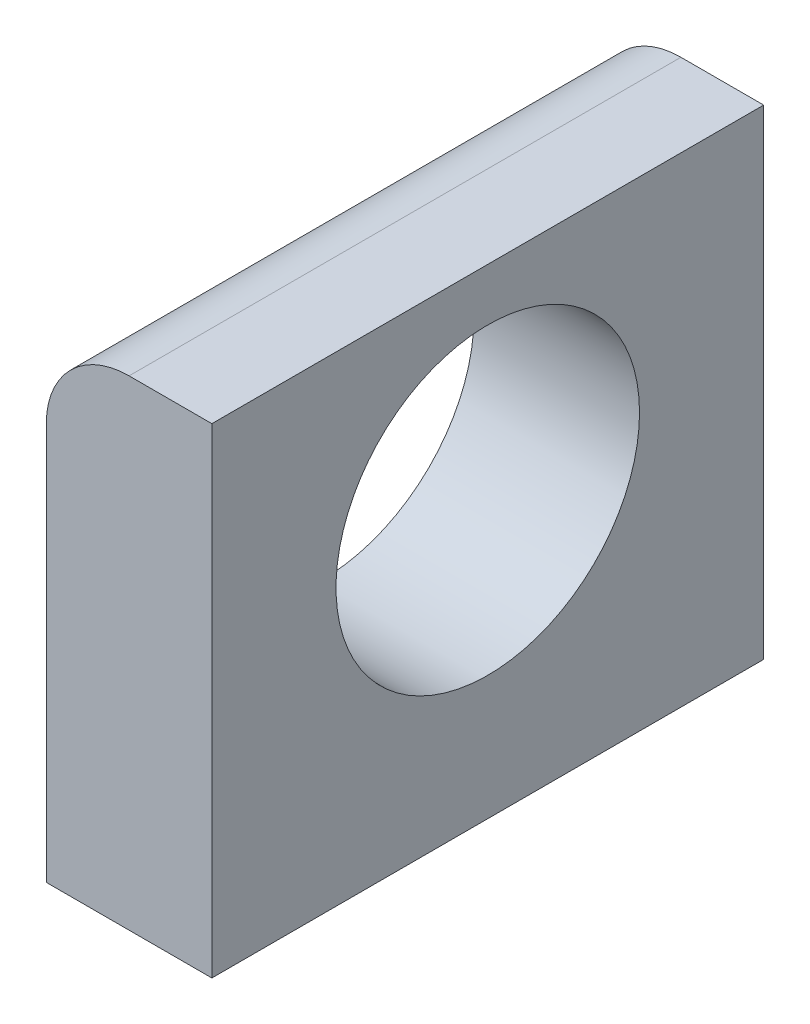
ISO-10303-21;
HEADER;
FILE_DESCRIPTION(('STEP AP214'),'2;1');
FILE_NAME('part.step','',(''),(''),'','','');
FILE_SCHEMA(('AUTOMOTIVE_DESIGN { 1 0 10303 214 1 1 1 1 }'));
ENDSEC;
DATA;
#1=APPLICATION_CONTEXT('core data for automotive mechanical design processes');
#2=APPLICATION_PROTOCOL_DEFINITION('international standard','automotive_design',2000,#1);
#3=PRODUCT_CONTEXT('',#1,'mechanical');
#4=PRODUCT('Part','Part','',(#3));
#5=PRODUCT_RELATED_PRODUCT_CATEGORY('part','',(#4));
#6=PRODUCT_DEFINITION_FORMATION('','',#4);
#7=PRODUCT_DEFINITION_CONTEXT('part definition',#1,'design');
#8=PRODUCT_DEFINITION('design','',#6,#7);
#9=PRODUCT_DEFINITION_SHAPE('','',#8);
#10=(LENGTH_UNIT() NAMED_UNIT(*) SI_UNIT(.MILLI.,.METRE.));
#11=(NAMED_UNIT(*) PLANE_ANGLE_UNIT() SI_UNIT($,.RADIAN.));
#12=(NAMED_UNIT(*) SI_UNIT($,.STERADIAN.) SOLID_ANGLE_UNIT());
#13=UNCERTAINTY_MEASURE_WITH_UNIT(LENGTH_MEASURE(1.E-05),#10,'distance_accuracy_value','');
#14=(GEOMETRIC_REPRESENTATION_CONTEXT(3) GLOBAL_UNCERTAINTY_ASSIGNED_CONTEXT((#13)) GLOBAL_UNIT_ASSIGNED_CONTEXT((#10,
#11,#12)) REPRESENTATION_CONTEXT('',''));
#15=CARTESIAN_POINT('',(0.,0.,0.));
#16=DIRECTION('',(0.,0.,1.));
#17=DIRECTION('',(1.,0.,0.));
#18=AXIS2_PLACEMENT_3D('',#15,#16,#17);
#19=CARTESIAN_POINT('',(1.5,-4.35,10.));
#20=DIRECTION('',(-1.,0.,0.));
#21=DIRECTION('',(0.,0.,1.));
#22=AXIS2_PLACEMENT_3D('',#19,#20,#21);
#23=PLANE('',#22);
#24=CARTESIAN_POINT('',(1.5,0.65,5.));
#25=DIRECTION('',(1.,0.,0.));
#26=DIRECTION('',(0.,0.,-1.));
#27=AXIS2_PLACEMENT_3D('',#24,#25,#26);
#28=CIRCLE('',#27,2.75);
#29=CARTESIAN_POINT('',(1.5,0.65,2.25));
#30=VERTEX_POINT('',#29);
#31=EDGE_CURVE('E131',#30,#30,#28,.T.);
#32=ORIENTED_EDGE('',*,*,#31,.F.);
#33=EDGE_LOOP('',(#32));
#34=FACE_BOUND('',#33,.T.);
#35=DIRECTION('',(0.,1.,0.));
#36=VECTOR('',#35,1.);
#37=CARTESIAN_POINT('',(1.5,-4.35,0.));
#38=LINE('',#37,#36);
#39=CARTESIAN_POINT('',(1.5,-4.35,0.));
#40=VERTEX_POINT('',#39);
#41=CARTESIAN_POINT('',(1.5,4.35,0.));
#42=VERTEX_POINT('',#41);
#43=EDGE_CURVE('E114',#40,#42,#38,.T.);
#44=ORIENTED_EDGE('',*,*,#43,.T.);
#45=DIRECTION('',(0.,0.,-1.));
#46=VECTOR('',#45,1.);
#47=CARTESIAN_POINT('',(1.5,4.35,10.));
#48=LINE('',#47,#46);
#49=CARTESIAN_POINT('',(1.5,4.35,10.));
#50=VERTEX_POINT('',#49);
#51=EDGE_CURVE('E95',#50,#42,#48,.T.);
#52=ORIENTED_EDGE('',*,*,#51,.F.);
#53=DIRECTION('',(0.,1.,0.));
#54=VECTOR('',#53,1.);
#55=CARTESIAN_POINT('',(1.5,-4.35,10.));
#56=LINE('',#55,#54);
#57=CARTESIAN_POINT('',(1.5,-4.35,10.));
#58=VERTEX_POINT('',#57);
#59=EDGE_CURVE('E101',#58,#50,#56,.T.);
#60=ORIENTED_EDGE('',*,*,#59,.F.);
#61=DIRECTION('',(0.,0.,-1.));
#62=VECTOR('',#61,1.);
#63=CARTESIAN_POINT('',(1.5,-4.35,10.));
#64=LINE('',#63,#62);
#65=EDGE_CURVE('E124',#58,#40,#64,.T.);
#66=ORIENTED_EDGE('',*,*,#65,.T.);
#67=EDGE_LOOP('',(#44,#52,#60,#66));
#68=FACE_BOUND('',#67,.T.);
#69=ADVANCED_FACE('F39',(#34,#68),#23,.F.);
#70=CARTESIAN_POINT('',(-1.5,4.35,10.));
#71=DIRECTION('',(0.,-1.,0.));
#72=DIRECTION('',(0.,0.,-1.));
#73=AXIS2_PLACEMENT_3D('',#70,#71,#72);
#74=PLANE('',#73);
#75=DIRECTION('',(-1.,0.,0.));
#76=VECTOR('',#75,1.);
#77=CARTESIAN_POINT('',(-1.5,4.35,0.));
#78=LINE('',#77,#76);
#79=CARTESIAN_POINT('',(0.,4.35,0.));
#80=VERTEX_POINT('',#79);
#81=EDGE_CURVE('E178',#42,#80,#78,.T.);
#82=ORIENTED_EDGE('',*,*,#81,.T.);
#83=DIRECTION('',(0.,0.,-1.));
#84=VECTOR('',#83,1.);
#85=CARTESIAN_POINT('',(0.,4.35,10.));
#86=LINE('',#85,#84);
#87=CARTESIAN_POINT('',(0.,4.35,10.));
#88=VERTEX_POINT('',#87);
#89=EDGE_CURVE('E49',#80,#88,#86,.F.);
#90=ORIENTED_EDGE('',*,*,#89,.T.);
#91=DIRECTION('',(-1.,0.,0.));
#92=VECTOR('',#91,1.);
#93=CARTESIAN_POINT('',(-1.5,4.35,10.));
#94=LINE('',#93,#92);
#95=EDGE_CURVE('E91',#50,#88,#94,.T.);
#96=ORIENTED_EDGE('',*,*,#95,.F.);
#97=ORIENTED_EDGE('',*,*,#51,.T.);
#98=EDGE_LOOP('',(#82,#90,#96,#97));
#99=FACE_BOUND('',#98,.T.);
#100=ADVANCED_FACE('F93',(#99),#74,.F.);
#101=CARTESIAN_POINT('',(-1.5,-4.35,10.));
#102=DIRECTION('',(1.,0.,0.));
#103=DIRECTION('',(0.,0.,-1.));
#104=AXIS2_PLACEMENT_3D('',#101,#102,#103);
#105=PLANE('',#104);
#106=DIRECTION('',(0.,-1.,0.));
#107=VECTOR('',#106,1.);
#108=CARTESIAN_POINT('',(-1.5,-4.35,10.));
#109=LINE('',#108,#107);
#110=CARTESIAN_POINT('',(-1.5,2.85,10.));
#111=VERTEX_POINT('',#110);
#112=CARTESIAN_POINT('',(-1.5,-4.35,10.));
#113=VERTEX_POINT('',#112);
#114=EDGE_CURVE('E100',#111,#113,#109,.T.);
#115=ORIENTED_EDGE('',*,*,#114,.F.);
#116=DIRECTION('',(0.,0.,-1.));
#117=VECTOR('',#116,1.);
#118=CARTESIAN_POINT('',(-1.5,2.85,10.));
#119=LINE('',#118,#117);
#120=CARTESIAN_POINT('',(-1.5,2.85,6.65));
#121=VERTEX_POINT('',#120);
#122=EDGE_CURVE('E121',#111,#121,#119,.T.);
#123=ORIENTED_EDGE('',*,*,#122,.T.);
#124=CARTESIAN_POINT('',(-1.5,0.65,5.));
#125=DIRECTION('',(1.,0.,0.));
#126=DIRECTION('',(0.,0.,-1.));
#127=AXIS2_PLACEMENT_3D('',#124,#125,#126);
#128=CIRCLE('',#127,2.75);
#129=CARTESIAN_POINT('',(-1.5,2.85,3.35));
#130=VERTEX_POINT('',#129);
#131=EDGE_CURVE('E128',#121,#130,#128,.T.);
#132=ORIENTED_EDGE('',*,*,#131,.T.);
#133=DIRECTION('',(0.,0.,-1.));
#134=VECTOR('',#133,1.);
#135=CARTESIAN_POINT('',(-1.5,2.85,10.));
#136=LINE('',#135,#134);
#137=CARTESIAN_POINT('',(-1.5,2.85,0.));
#138=VERTEX_POINT('',#137);
#139=EDGE_CURVE('E116',#130,#138,#136,.T.);
#140=ORIENTED_EDGE('',*,*,#139,.T.);
#141=DIRECTION('',(0.,-1.,0.));
#142=VECTOR('',#141,1.);
#143=CARTESIAN_POINT('',(-1.5,-4.35,0.));
#144=LINE('',#143,#142);
#145=CARTESIAN_POINT('',(-1.5,-4.35,0.));
#146=VERTEX_POINT('',#145);
#147=EDGE_CURVE('E181',#138,#146,#144,.T.);
#148=ORIENTED_EDGE('',*,*,#147,.T.);
#149=DIRECTION('',(0.,0.,-1.));
#150=VECTOR('',#149,1.);
#151=CARTESIAN_POINT('',(-1.5,-4.35,10.));
#152=LINE('',#151,#150);
#153=EDGE_CURVE('E117',#113,#146,#152,.T.);
#154=ORIENTED_EDGE('',*,*,#153,.F.);
#155=EDGE_LOOP('',(#115,#123,#132,#140,#148,#154));
#156=FACE_BOUND('',#155,.T.);
#157=ADVANCED_FACE('F157',(#156),#105,.F.);
#158=CARTESIAN_POINT('',(-1.5,-4.35,10.));
#159=DIRECTION('',(0.,1.,0.));
#160=DIRECTION('',(0.,0.,1.));
#161=AXIS2_PLACEMENT_3D('',#158,#159,#160);
#162=PLANE('',#161);
#163=DIRECTION('',(1.,0.,0.));
#164=VECTOR('',#163,1.);
#165=CARTESIAN_POINT('',(-1.5,-4.35,0.));
#166=LINE('',#165,#164);
#167=EDGE_CURVE('E111',#146,#40,#166,.T.);
#168=ORIENTED_EDGE('',*,*,#167,.T.);
#169=ORIENTED_EDGE('',*,*,#65,.F.);
#170=DIRECTION('',(1.,0.,0.));
#171=VECTOR('',#170,1.);
#172=CARTESIAN_POINT('',(-1.5,-4.35,10.));
#173=LINE('',#172,#171);
#174=EDGE_CURVE('E106',#113,#58,#173,.T.);
#175=ORIENTED_EDGE('',*,*,#174,.F.);
#176=ORIENTED_EDGE('',*,*,#153,.T.);
#177=EDGE_LOOP('',(#168,#169,#175,#176));
#178=FACE_BOUND('',#177,.T.);
#179=ADVANCED_FACE('F152',(#178),#162,.F.);
#180=CARTESIAN_POINT('',(0.,0.,10.));
#181=DIRECTION('',(0.,0.,-1.));
#182=DIRECTION('',(-1.,0.,0.));
#183=AXIS2_PLACEMENT_3D('',#180,#181,#182);
#184=PLANE('',#183);
#185=ORIENTED_EDGE('',*,*,#95,.T.);
#186=CARTESIAN_POINT('',(0.,2.85,10.));
#187=DIRECTION('',(0.,0.,-1.));
#188=DIRECTION('',(-1.,0.,0.));
#189=AXIS2_PLACEMENT_3D('',#186,#187,#188);
#190=CIRCLE('',#189,1.5);
#191=EDGE_CURVE('E11',#88,#111,#190,.F.);
#192=ORIENTED_EDGE('',*,*,#191,.T.);
#193=ORIENTED_EDGE('',*,*,#114,.T.);
#194=ORIENTED_EDGE('',*,*,#174,.T.);
#195=ORIENTED_EDGE('',*,*,#59,.T.);
#196=EDGE_LOOP('',(#185,#192,#193,#194,#195));
#197=FACE_BOUND('',#196,.T.);
#198=ADVANCED_FACE('F104',(#197),#184,.F.);
#199=CARTESIAN_POINT('',(0.,0.,0.));
#200=DIRECTION('',(0.,0.,-1.));
#201=DIRECTION('',(-1.,0.,0.));
#202=AXIS2_PLACEMENT_3D('',#199,#200,#201);
#203=PLANE('',#202);
#204=ORIENTED_EDGE('',*,*,#147,.F.);
#205=CARTESIAN_POINT('',(0.,2.85,0.));
#206=DIRECTION('',(0.,0.,-1.));
#207=DIRECTION('',(-1.,0.,0.));
#208=AXIS2_PLACEMENT_3D('',#205,#206,#207);
#209=CIRCLE('',#208,1.5);
#210=EDGE_CURVE('E63',#138,#80,#209,.T.);
#211=ORIENTED_EDGE('',*,*,#210,.T.);
#212=ORIENTED_EDGE('',*,*,#81,.F.);
#213=ORIENTED_EDGE('',*,*,#43,.F.);
#214=ORIENTED_EDGE('',*,*,#167,.F.);
#215=EDGE_LOOP('',(#204,#211,#212,#213,#214));
#216=FACE_BOUND('',#215,.T.);
#217=ADVANCED_FACE('F148',(#216),#203,.T.);
#218=CARTESIAN_POINT('',(-8.5,0.65,5.));
#219=DIRECTION('',(1.,0.,0.));
#220=DIRECTION('',(0.,0.,-1.));
#221=AXIS2_PLACEMENT_3D('',#218,#219,#220);
#222=CYLINDRICAL_SURFACE('',#221,2.75);
#223=ORIENTED_EDGE('',*,*,#31,.T.);
#224=EDGE_LOOP('',(#223));
#225=FACE_BOUND('',#224,.T.);
#226=ORIENTED_EDGE('',*,*,#131,.F.);
#227=CARTESIAN_POINT('',(-1.5,2.85,6.65));
#228=CARTESIAN_POINT('',(-1.4999905831215,2.88806448166908,6.59925562624504));
#229=CARTESIAN_POINT('',(-1.49855155608313,2.92434708976143,6.54721295916865));
#230=CARTESIAN_POINT('',(-1.49355271392178,2.99316619195589,6.4408585105021));
#231=CARTESIAN_POINT('',(-1.48999459277845,3.02570565352359,6.38654857355345));
#232=CARTESIAN_POINT('',(-1.48148623886507,3.08697056892362,6.27580895316935));
#233=CARTESIAN_POINT('',(-1.47653359676252,3.11568929404021,6.21937574883936));
#234=CARTESIAN_POINT('',(-1.46590768390427,3.16915197529463,6.10470633227281));
#235=CARTESIAN_POINT('',(-1.46023420286996,3.19389476680902,6.04646959768578));
#236=CARTESIAN_POINT('',(-1.44790543679509,3.24281219219997,5.91932204087167));
#237=CARTESIAN_POINT('',(-1.44123377985012,3.26630960758789,5.85015114784915));
#238=CARTESIAN_POINT('',(-1.42861525249809,3.30774218320302,5.71009809765009));
#239=CARTESIAN_POINT('',(-1.42266838072491,3.32567735391439,5.63921594369934));
#240=CARTESIAN_POINT('',(-1.41222489879271,3.35584192355545,5.49623563080924));
#241=CARTESIAN_POINT('',(-1.40772638299806,3.36807882937025,5.42413920211759));
#242=CARTESIAN_POINT('',(-1.40070378353106,3.38677661136549,5.2791047958697));
#243=CARTESIAN_POINT('',(-1.39817964345173,3.3932376525604,5.20616684241584));
#244=CARTESIAN_POINT('',(-1.39536125967271,3.40043931354692,5.05749848028384));
#245=CARTESIAN_POINT('',(-1.39514496320312,3.40097998903885,4.98175674161381));
#246=CARTESIAN_POINT('',(-1.397173051912,3.39581539092247,4.83051859044357));
#247=CARTESIAN_POINT('',(-1.39941757575981,3.39010976532975,4.75502219200893));
#248=CARTESIAN_POINT('',(-1.40608989739345,3.37249449784228,4.60470077006002));
#249=CARTESIAN_POINT('',(-1.41052207081717,3.36057241937252,4.52987739937496));
#250=CARTESIAN_POINT('',(-1.42099853828635,3.33063444169608,4.38159672539286));
#251=CARTESIAN_POINT('',(-1.42704279504061,3.31261868344777,4.30813939053828));
#252=CARTESIAN_POINT('',(-1.44611538156669,3.25076053676273,4.09438190862685));
#253=CARTESIAN_POINT('',(-1.46034539216954,3.1986016089628,3.95652420119219));
#254=CARTESIAN_POINT('',(-1.48471790045566,3.0728897572499,3.69097197084044));
#255=CARTESIAN_POINT('',(-1.49487485578824,2.99941412909203,3.56324281506677));
#256=CARTESIAN_POINT('',(-1.49948169106667,2.89477610056263,3.41099787643115));
#257=CARTESIAN_POINT('',(-1.49999446838902,2.87270229523103,3.38026222567546));
#258=CARTESIAN_POINT('',(-1.5,2.85,3.35));
#259=B_SPLINE_CURVE_WITH_KNOTS('',3,(#227,#228,#229,#230,#231,#232,#233,#234,#235,#236,#237,
#238,#239,#240,#241,#242,#243,#244,#245,#246,#247,#248,#249,#250,#251,#252,#253,#254,#255,#256,
#257,#258),.UNSPECIFIED.,.F.,.F.,(4,2,2,2,2,2,2,2,2,2,2,2,2,2,2,4),(0.,0.190205324577212,
0.380258804887956,0.570642679459805,0.761082219682265,0.980917333091738,1.20075203213634,
1.42029629620174,1.63983428776195,1.86676458820046,2.09370767701356,2.32110653788615,
2.54850013895168,2.99081120326399,3.43153804702527,3.54503448849278),.UNSPECIFIED.);
#260=EDGE_CURVE('E136',#121,#130,#259,.T.);
#261=ORIENTED_EDGE('',*,*,#260,.T.);
#262=EDGE_LOOP('',(#226,#261));
#263=FACE_BOUND('',#262,.T.);
#264=ADVANCED_FACE('F144',(#225,#263),#222,.F.);
#265=CARTESIAN_POINT('',(0.,2.85,10.));
#266=DIRECTION('',(0.,0.,-1.));
#267=DIRECTION('',(-1.,0.,0.));
#268=AXIS2_PLACEMENT_3D('',#265,#266,#267);
#269=CYLINDRICAL_SURFACE('',#268,1.5);
#270=ORIENTED_EDGE('',*,*,#191,.F.);
#271=ORIENTED_EDGE('',*,*,#89,.F.);
#272=ORIENTED_EDGE('',*,*,#210,.F.);
#273=ORIENTED_EDGE('',*,*,#139,.F.);
#274=ORIENTED_EDGE('',*,*,#260,.F.);
#275=ORIENTED_EDGE('',*,*,#122,.F.);
#276=EDGE_LOOP('',(#270,#271,#272,#273,#274,#275));
#277=FACE_BOUND('',#276,.T.);
#278=ADVANCED_FACE('F41',(#277),#269,.T.);
#279=CLOSED_SHELL('',(#69,#100,#157,#179,#198,#217,#264,#278));
#280=MANIFOLD_SOLID_BREP('B2',#279);
#281=ADVANCED_BREP_SHAPE_REPRESENTATION('',(#18,#280),#14);
#282=SHAPE_DEFINITION_REPRESENTATION(#9,#281);
ENDSEC;
END-ISO-10303-21;
